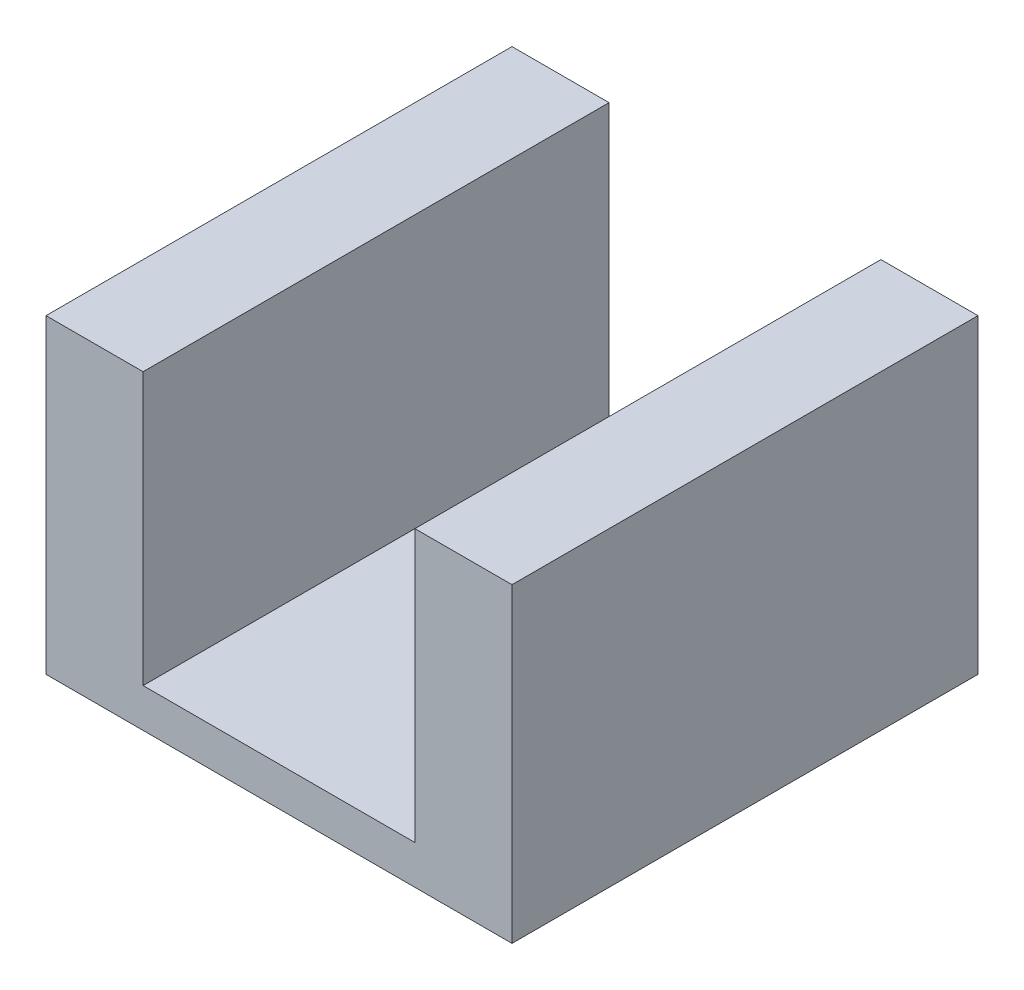
ISO-10303-21;
HEADER;
FILE_DESCRIPTION(('STEP AP214'),'2;1');
FILE_NAME('part.step','',(''),(''),'','','');
FILE_SCHEMA(('AUTOMOTIVE_DESIGN { 1 0 10303 214 1 1 1 1 }'));
ENDSEC;
DATA;
#1=APPLICATION_CONTEXT('core data for automotive mechanical design processes');
#2=APPLICATION_PROTOCOL_DEFINITION('international standard','automotive_design',2000,#1);
#3=PRODUCT_CONTEXT('',#1,'mechanical');
#4=PRODUCT('Part','Part','',(#3));
#5=PRODUCT_RELATED_PRODUCT_CATEGORY('part','',(#4));
#6=PRODUCT_DEFINITION_FORMATION('','',#4);
#7=PRODUCT_DEFINITION_CONTEXT('part definition',#1,'design');
#8=PRODUCT_DEFINITION('design','',#6,#7);
#9=PRODUCT_DEFINITION_SHAPE('','',#8);
#10=(LENGTH_UNIT() NAMED_UNIT(*) SI_UNIT(.MILLI.,.METRE.));
#11=(NAMED_UNIT(*) PLANE_ANGLE_UNIT() SI_UNIT($,.RADIAN.));
#12=(NAMED_UNIT(*) SI_UNIT($,.STERADIAN.) SOLID_ANGLE_UNIT());
#13=UNCERTAINTY_MEASURE_WITH_UNIT(LENGTH_MEASURE(1.E-05),#10,'distance_accuracy_value','');
#14=(GEOMETRIC_REPRESENTATION_CONTEXT(3) GLOBAL_UNCERTAINTY_ASSIGNED_CONTEXT((#13)) GLOBAL_UNIT_ASSIGNED_CONTEXT((#10,
#11,#12)) REPRESENTATION_CONTEXT('',''));
#15=CARTESIAN_POINT('',(0.,0.,0.));
#16=DIRECTION('',(0.,0.,1.));
#17=DIRECTION('',(1.,0.,0.));
#18=AXIS2_PLACEMENT_3D('',#15,#16,#17);
#19=CARTESIAN_POINT('',(38.1,44.45,76.2));
#20=DIRECTION('',(-1.,0.,0.));
#21=DIRECTION('',(0.,-1.,0.));
#22=AXIS2_PLACEMENT_3D('',#19,#20,#21);
#23=PLANE('',#22);
#24=DIRECTION('',(0.,1.,0.));
#25=VECTOR('',#24,1.);
#26=CARTESIAN_POINT('',(38.1,44.45,0.));
#27=LINE('',#26,#25);
#28=CARTESIAN_POINT('',(38.1,-6.35,0.));
#29=VERTEX_POINT('',#28);
#30=CARTESIAN_POINT('',(38.1,44.45,0.));
#31=VERTEX_POINT('',#30);
#32=EDGE_CURVE('E129',#29,#31,#27,.T.);
#33=ORIENTED_EDGE('',*,*,#32,.T.);
#34=DIRECTION('',(0.,0.,-1.));
#35=VECTOR('',#34,1.);
#36=CARTESIAN_POINT('',(38.1,44.45,76.2));
#37=LINE('',#36,#35);
#38=CARTESIAN_POINT('',(38.1,44.45,76.2));
#39=VERTEX_POINT('',#38);
#40=EDGE_CURVE('E11',#39,#31,#37,.T.);
#41=ORIENTED_EDGE('',*,*,#40,.F.);
#42=DIRECTION('',(0.,1.,0.));
#43=VECTOR('',#42,1.);
#44=CARTESIAN_POINT('',(38.1,44.45,76.2));
#45=LINE('',#44,#43);
#46=CARTESIAN_POINT('',(38.1,-6.35,76.2));
#47=VERTEX_POINT('',#46);
#48=EDGE_CURVE('E144',#47,#39,#45,.T.);
#49=ORIENTED_EDGE('',*,*,#48,.F.);
#50=DIRECTION('',(0.,0.,-1.));
#51=VECTOR('',#50,1.);
#52=CARTESIAN_POINT('',(38.1,-6.35,76.2));
#53=LINE('',#52,#51);
#54=EDGE_CURVE('E125',#47,#29,#53,.T.);
#55=ORIENTED_EDGE('',*,*,#54,.T.);
#56=EDGE_LOOP('',(#33,#41,#49,#55));
#57=FACE_BOUND('',#56,.T.);
#58=ADVANCED_FACE('F33',(#57),#23,.F.);
#59=CARTESIAN_POINT('',(22.225,44.45,76.2));
#60=DIRECTION('',(0.,-1.,0.));
#61=DIRECTION('',(0.,0.,-1.));
#62=AXIS2_PLACEMENT_3D('',#59,#60,#61);
#63=PLANE('',#62);
#64=DIRECTION('',(-1.,0.,0.));
#65=VECTOR('',#64,1.);
#66=CARTESIAN_POINT('',(22.225,44.45,0.));
#67=LINE('',#66,#65);
#68=CARTESIAN_POINT('',(22.225,44.45,0.));
#69=VERTEX_POINT('',#68);
#70=EDGE_CURVE('E132',#31,#69,#67,.T.);
#71=ORIENTED_EDGE('',*,*,#70,.T.);
#72=DIRECTION('',(0.,0.,-1.));
#73=VECTOR('',#72,1.);
#74=CARTESIAN_POINT('',(22.225,44.45,76.2));
#75=LINE('',#74,#73);
#76=CARTESIAN_POINT('',(22.225,44.45,76.2));
#77=VERTEX_POINT('',#76);
#78=EDGE_CURVE('E41',#77,#69,#75,.T.);
#79=ORIENTED_EDGE('',*,*,#78,.F.);
#80=DIRECTION('',(-1.,0.,0.));
#81=VECTOR('',#80,1.);
#82=CARTESIAN_POINT('',(22.225,44.45,76.2));
#83=LINE('',#82,#81);
#84=EDGE_CURVE('E92',#39,#77,#83,.T.);
#85=ORIENTED_EDGE('',*,*,#84,.F.);
#86=ORIENTED_EDGE('',*,*,#40,.T.);
#87=EDGE_LOOP('',(#71,#79,#85,#86));
#88=FACE_BOUND('',#87,.T.);
#89=ADVANCED_FACE('F198',(#88),#63,.F.);
#90=CARTESIAN_POINT('',(22.225,0.,76.2));
#91=DIRECTION('',(1.,0.,0.));
#92=DIRECTION('',(0.,0.,-1.));
#93=AXIS2_PLACEMENT_3D('',#90,#91,#92);
#94=PLANE('',#93);
#95=DIRECTION('',(0.,-1.,0.));
#96=VECTOR('',#95,1.);
#97=CARTESIAN_POINT('',(22.225,0.,0.));
#98=LINE('',#97,#96);
#99=CARTESIAN_POINT('',(22.225,0.,0.));
#100=VERTEX_POINT('',#99);
#101=EDGE_CURVE('E135',#69,#100,#98,.T.);
#102=ORIENTED_EDGE('',*,*,#101,.T.);
#103=DIRECTION('',(0.,0.,-1.));
#104=VECTOR('',#103,1.);
#105=CARTESIAN_POINT('',(22.225,0.,76.2));
#106=LINE('',#105,#104);
#107=CARTESIAN_POINT('',(22.225,0.,76.2));
#108=VERTEX_POINT('',#107);
#109=EDGE_CURVE('E151',#108,#100,#106,.T.);
#110=ORIENTED_EDGE('',*,*,#109,.F.);
#111=DIRECTION('',(0.,-1.,0.));
#112=VECTOR('',#111,1.);
#113=CARTESIAN_POINT('',(22.225,0.,76.2));
#114=LINE('',#113,#112);
#115=EDGE_CURVE('E159',#77,#108,#114,.T.);
#116=ORIENTED_EDGE('',*,*,#115,.F.);
#117=ORIENTED_EDGE('',*,*,#78,.T.);
#118=EDGE_LOOP('',(#102,#110,#116,#117));
#119=FACE_BOUND('',#118,.T.);
#120=ADVANCED_FACE('F157',(#119),#94,.F.);
#121=CARTESIAN_POINT('',(22.225,0.,76.2));
#122=DIRECTION('',(0.,-1.,0.));
#123=DIRECTION('',(0.,0.,-1.));
#124=AXIS2_PLACEMENT_3D('',#121,#122,#123);
#125=PLANE('',#124);
#126=CARTESIAN_POINT('',(0.,0.,38.1));
#127=DIRECTION('',(0.,1.,0.));
#128=DIRECTION('',(0.,0.,1.));
#129=AXIS2_PLACEMENT_3D('',#126,#127,#128);
#130=CIRCLE('',#129,7.9375);
#131=CARTESIAN_POINT('',(0.,0.,46.0375));
#132=VERTEX_POINT('',#131);
#133=EDGE_CURVE('E177',#132,#132,#130,.T.);
#134=ORIENTED_EDGE('',*,*,#133,.F.);
#135=EDGE_LOOP('',(#134));
#136=FACE_BOUND('',#135,.T.);
#137=DIRECTION('',(-1.,0.,0.));
#138=VECTOR('',#137,1.);
#139=CARTESIAN_POINT('',(22.225,0.,0.));
#140=LINE('',#139,#138);
#141=CARTESIAN_POINT('',(-22.225,0.,0.));
#142=VERTEX_POINT('',#141);
#143=EDGE_CURVE('E137',#100,#142,#140,.T.);
#144=ORIENTED_EDGE('',*,*,#143,.T.);
#145=DIRECTION('',(0.,0.,-1.));
#146=VECTOR('',#145,1.);
#147=CARTESIAN_POINT('',(-22.225,0.,76.2));
#148=LINE('',#147,#146);
#149=CARTESIAN_POINT('',(-22.225,0.,76.2));
#150=VERTEX_POINT('',#149);
#151=EDGE_CURVE('E148',#150,#142,#148,.T.);
#152=ORIENTED_EDGE('',*,*,#151,.F.);
#153=DIRECTION('',(-1.,0.,0.));
#154=VECTOR('',#153,1.);
#155=CARTESIAN_POINT('',(22.225,0.,76.2));
#156=LINE('',#155,#154);
#157=EDGE_CURVE('E171',#108,#150,#156,.T.);
#158=ORIENTED_EDGE('',*,*,#157,.F.);
#159=ORIENTED_EDGE('',*,*,#109,.T.);
#160=EDGE_LOOP('',(#144,#152,#158,#159));
#161=FACE_BOUND('',#160,.T.);
#162=ADVANCED_FACE('F167',(#136,#161),#125,.F.);
#163=CARTESIAN_POINT('',(-22.225,0.,76.2));
#164=DIRECTION('',(-1.,0.,0.));
#165=DIRECTION('',(0.,0.,1.));
#166=AXIS2_PLACEMENT_3D('',#163,#164,#165);
#167=PLANE('',#166);
#168=DIRECTION('',(0.,1.,0.));
#169=VECTOR('',#168,1.);
#170=CARTESIAN_POINT('',(-22.225,0.,0.));
#171=LINE('',#170,#169);
#172=CARTESIAN_POINT('',(-22.225,44.45,0.));
#173=VERTEX_POINT('',#172);
#174=EDGE_CURVE('E139',#142,#173,#171,.T.);
#175=ORIENTED_EDGE('',*,*,#174,.T.);
#176=DIRECTION('',(0.,0.,-1.));
#177=VECTOR('',#176,1.);
#178=CARTESIAN_POINT('',(-22.225,44.45,76.2));
#179=LINE('',#178,#177);
#180=CARTESIAN_POINT('',(-22.225,44.45,76.2));
#181=VERTEX_POINT('',#180);
#182=EDGE_CURVE('E120',#181,#173,#179,.T.);
#183=ORIENTED_EDGE('',*,*,#182,.F.);
#184=DIRECTION('',(0.,1.,0.));
#185=VECTOR('',#184,1.);
#186=CARTESIAN_POINT('',(-22.225,0.,76.2));
#187=LINE('',#186,#185);
#188=EDGE_CURVE('E111',#150,#181,#187,.T.);
#189=ORIENTED_EDGE('',*,*,#188,.F.);
#190=ORIENTED_EDGE('',*,*,#151,.T.);
#191=EDGE_LOOP('',(#175,#183,#189,#190));
#192=FACE_BOUND('',#191,.T.);
#193=ADVANCED_FACE('F170',(#192),#167,.F.);
#194=CARTESIAN_POINT('',(-22.225,44.45,76.2));
#195=DIRECTION('',(0.,-1.,0.));
#196=DIRECTION('',(0.,0.,-1.));
#197=AXIS2_PLACEMENT_3D('',#194,#195,#196);
#198=PLANE('',#197);
#199=DIRECTION('',(-1.,0.,0.));
#200=VECTOR('',#199,1.);
#201=CARTESIAN_POINT('',(-22.225,44.45,0.));
#202=LINE('',#201,#200);
#203=CARTESIAN_POINT('',(-38.1,44.45,0.));
#204=VERTEX_POINT('',#203);
#205=EDGE_CURVE('E119',#173,#204,#202,.T.);
#206=ORIENTED_EDGE('',*,*,#205,.T.);
#207=DIRECTION('',(0.,0.,-1.));
#208=VECTOR('',#207,1.);
#209=CARTESIAN_POINT('',(-38.1,44.45,76.2));
#210=LINE('',#209,#208);
#211=CARTESIAN_POINT('',(-38.1,44.45,76.2));
#212=VERTEX_POINT('',#211);
#213=EDGE_CURVE('E116',#212,#204,#210,.T.);
#214=ORIENTED_EDGE('',*,*,#213,.F.);
#215=DIRECTION('',(-1.,0.,0.));
#216=VECTOR('',#215,1.);
#217=CARTESIAN_POINT('',(-22.225,44.45,76.2));
#218=LINE('',#217,#216);
#219=EDGE_CURVE('E105',#181,#212,#218,.T.);
#220=ORIENTED_EDGE('',*,*,#219,.F.);
#221=ORIENTED_EDGE('',*,*,#182,.T.);
#222=EDGE_LOOP('',(#206,#214,#220,#221));
#223=FACE_BOUND('',#222,.T.);
#224=ADVANCED_FACE('F117',(#223),#198,.F.);
#225=CARTESIAN_POINT('',(-38.1,44.45,76.2));
#226=DIRECTION('',(1.,0.,0.));
#227=DIRECTION('',(0.,1.,0.));
#228=AXIS2_PLACEMENT_3D('',#225,#226,#227);
#229=PLANE('',#228);
#230=DIRECTION('',(0.,-1.,0.));
#231=VECTOR('',#230,1.);
#232=CARTESIAN_POINT('',(-38.1,44.45,0.));
#233=LINE('',#232,#231);
#234=CARTESIAN_POINT('',(-38.1,-6.35,0.));
#235=VERTEX_POINT('',#234);
#236=EDGE_CURVE('E78',#204,#235,#233,.T.);
#237=ORIENTED_EDGE('',*,*,#236,.T.);
#238=DIRECTION('',(0.,0.,-1.));
#239=VECTOR('',#238,1.);
#240=CARTESIAN_POINT('',(-38.1,-6.35,76.2));
#241=LINE('',#240,#239);
#242=CARTESIAN_POINT('',(-38.1,-6.35,76.2));
#243=VERTEX_POINT('',#242);
#244=EDGE_CURVE('E121',#243,#235,#241,.T.);
#245=ORIENTED_EDGE('',*,*,#244,.F.);
#246=DIRECTION('',(0.,-1.,0.));
#247=VECTOR('',#246,1.);
#248=CARTESIAN_POINT('',(-38.1,44.45,76.2));
#249=LINE('',#248,#247);
#250=EDGE_CURVE('E109',#212,#243,#249,.T.);
#251=ORIENTED_EDGE('',*,*,#250,.F.);
#252=ORIENTED_EDGE('',*,*,#213,.T.);
#253=EDGE_LOOP('',(#237,#245,#251,#252));
#254=FACE_BOUND('',#253,.T.);
#255=ADVANCED_FACE('F123',(#254),#229,.F.);
#256=CARTESIAN_POINT('',(-38.1,-6.35,76.2));
#257=DIRECTION('',(0.,1.,0.));
#258=DIRECTION('',(0.,0.,1.));
#259=AXIS2_PLACEMENT_3D('',#256,#257,#258);
#260=PLANE('',#259);
#261=CARTESIAN_POINT('',(0.,-6.35,38.1));
#262=DIRECTION('',(0.,1.,0.));
#263=DIRECTION('',(0.,0.,1.));
#264=AXIS2_PLACEMENT_3D('',#261,#262,#263);
#265=CIRCLE('',#264,7.9375);
#266=CARTESIAN_POINT('',(0.,-6.35,46.0375));
#267=VERTEX_POINT('',#266);
#268=EDGE_CURVE('E133',#267,#267,#265,.T.);
#269=ORIENTED_EDGE('',*,*,#268,.T.);
#270=EDGE_LOOP('',(#269));
#271=FACE_BOUND('',#270,.T.);
#272=DIRECTION('',(1.,0.,0.));
#273=VECTOR('',#272,1.);
#274=CARTESIAN_POINT('',(-38.1,-6.35,0.));
#275=LINE('',#274,#273);
#276=EDGE_CURVE('E84',#235,#29,#275,.T.);
#277=ORIENTED_EDGE('',*,*,#276,.T.);
#278=ORIENTED_EDGE('',*,*,#54,.F.);
#279=DIRECTION('',(1.,0.,0.));
#280=VECTOR('',#279,1.);
#281=CARTESIAN_POINT('',(-38.1,-6.35,76.2));
#282=LINE('',#281,#280);
#283=EDGE_CURVE('E49',#243,#47,#282,.T.);
#284=ORIENTED_EDGE('',*,*,#283,.F.);
#285=ORIENTED_EDGE('',*,*,#244,.T.);
#286=EDGE_LOOP('',(#277,#278,#284,#285));
#287=FACE_BOUND('',#286,.T.);
#288=ADVANCED_FACE('F183',(#271,#287),#260,.F.);
#289=CARTESIAN_POINT('',(0.,0.,76.2));
#290=DIRECTION('',(0.,0.,1.));
#291=DIRECTION('',(1.,0.,0.));
#292=AXIS2_PLACEMENT_3D('',#289,#290,#291);
#293=PLANE('',#292);
#294=ORIENTED_EDGE('',*,*,#48,.T.);
#295=ORIENTED_EDGE('',*,*,#84,.T.);
#296=ORIENTED_EDGE('',*,*,#115,.T.);
#297=ORIENTED_EDGE('',*,*,#157,.T.);
#298=ORIENTED_EDGE('',*,*,#188,.T.);
#299=ORIENTED_EDGE('',*,*,#219,.T.);
#300=ORIENTED_EDGE('',*,*,#250,.T.);
#301=ORIENTED_EDGE('',*,*,#283,.T.);
#302=EDGE_LOOP('',(#294,#295,#296,#297,#298,#299,#300,#301));
#303=FACE_BOUND('',#302,.T.);
#304=ADVANCED_FACE('F107',(#303),#293,.T.);
#305=CARTESIAN_POINT('',(0.,0.,0.));
#306=DIRECTION('',(0.,0.,1.));
#307=DIRECTION('',(1.,0.,0.));
#308=AXIS2_PLACEMENT_3D('',#305,#306,#307);
#309=PLANE('',#308);
#310=ORIENTED_EDGE('',*,*,#32,.F.);
#311=ORIENTED_EDGE('',*,*,#276,.F.);
#312=ORIENTED_EDGE('',*,*,#236,.F.);
#313=ORIENTED_EDGE('',*,*,#205,.F.);
#314=ORIENTED_EDGE('',*,*,#174,.F.);
#315=ORIENTED_EDGE('',*,*,#143,.F.);
#316=ORIENTED_EDGE('',*,*,#101,.F.);
#317=ORIENTED_EDGE('',*,*,#70,.F.);
#318=EDGE_LOOP('',(#310,#311,#312,#313,#314,#315,#316,#317));
#319=FACE_BOUND('',#318,.T.);
#320=ADVANCED_FACE('F163',(#319),#309,.F.);
#321=CARTESIAN_POINT('',(0.,-6.35,38.1));
#322=DIRECTION('',(0.,1.,0.));
#323=DIRECTION('',(0.,0.,1.));
#324=AXIS2_PLACEMENT_3D('',#321,#322,#323);
#325=CYLINDRICAL_SURFACE('',#324,7.9375);
#326=ORIENTED_EDGE('',*,*,#268,.F.);
#327=EDGE_LOOP('',(#326));
#328=FACE_BOUND('',#327,.T.);
#329=ORIENTED_EDGE('',*,*,#133,.T.);
#330=EDGE_LOOP('',(#329));
#331=FACE_BOUND('',#330,.T.);
#332=ADVANCED_FACE('F185',(#328,#331),#325,.F.);
#333=CLOSED_SHELL('',(#58,#89,#120,#162,#193,#224,#255,#288,#304,#320,#332));
#334=MANIFOLD_SOLID_BREP('B2',#333);
#335=ADVANCED_BREP_SHAPE_REPRESENTATION('',(#18,#334),#14);
#336=SHAPE_DEFINITION_REPRESENTATION(#9,#335);
ENDSEC;
END-ISO-10303-21;
